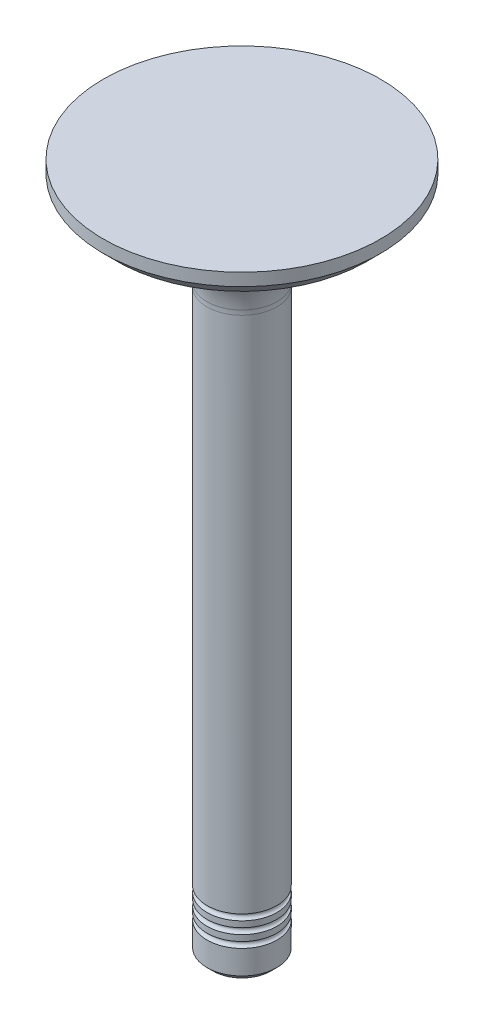
ISO-10303-21;
HEADER;
FILE_DESCRIPTION(('STEP AP214'),'2;1');
FILE_NAME('part.step','',(''),(''),'','','');
FILE_SCHEMA(('AUTOMOTIVE_DESIGN { 1 0 10303 214 1 1 1 1 }'));
ENDSEC;
DATA;
#1=APPLICATION_CONTEXT('core data for automotive mechanical design processes');
#2=APPLICATION_PROTOCOL_DEFINITION('international standard','automotive_design',2000,#1);
#3=PRODUCT_CONTEXT('',#1,'mechanical');
#4=PRODUCT('Part','Part','',(#3));
#5=PRODUCT_RELATED_PRODUCT_CATEGORY('part','',(#4));
#6=PRODUCT_DEFINITION_FORMATION('','',#4);
#7=PRODUCT_DEFINITION_CONTEXT('part definition',#1,'design');
#8=PRODUCT_DEFINITION('design','',#6,#7);
#9=PRODUCT_DEFINITION_SHAPE('','',#8);
#10=(LENGTH_UNIT() NAMED_UNIT(*) SI_UNIT(.MILLI.,.METRE.));
#11=(NAMED_UNIT(*) PLANE_ANGLE_UNIT() SI_UNIT($,.RADIAN.));
#12=(NAMED_UNIT(*) SI_UNIT($,.STERADIAN.) SOLID_ANGLE_UNIT());
#13=UNCERTAINTY_MEASURE_WITH_UNIT(LENGTH_MEASURE(1.E-05),#10,'distance_accuracy_value','');
#14=(GEOMETRIC_REPRESENTATION_CONTEXT(3) GLOBAL_UNCERTAINTY_ASSIGNED_CONTEXT((#13)) GLOBAL_UNIT_ASSIGNED_CONTEXT((#10,
#11,#12)) REPRESENTATION_CONTEXT('',''));
#15=CARTESIAN_POINT('',(0.,0.,0.));
#16=DIRECTION('',(0.,0.,1.));
#17=DIRECTION('',(1.,0.,0.));
#18=AXIS2_PLACEMENT_3D('',#15,#16,#17);
#19=CARTESIAN_POINT('',(0.,105.721798884299,0.));
#20=DIRECTION('',(0.,1.,0.));
#21=DIRECTION('',(-1.,0.,0.));
#22=AXIS2_PLACEMENT_3D('',#19,#20,#21);
#23=CYLINDRICAL_SURFACE('',#22,5.85);
#24=CARTESIAN_POINT('',(0.,87.1884022024718,0.));
#25=DIRECTION('',(0.,1.,0.));
#26=DIRECTION('',(-1.,0.,0.));
#27=AXIS2_PLACEMENT_3D('',#24,#25,#26);
#28=CIRCLE('',#27,5.85);
#29=CARTESIAN_POINT('',(-5.85,87.1884022024718,0.));
#30=VERTEX_POINT('',#29);
#31=EDGE_CURVE('E63',#30,#30,#28,.F.);
#32=ORIENTED_EDGE('',*,*,#31,.T.);
#33=EDGE_LOOP('',(#32));
#34=FACE_BOUND('',#33,.T.);
#35=CARTESIAN_POINT('',(0.,0.321798884299316,0.));
#36=DIRECTION('',(0.,-1.,0.));
#37=DIRECTION('',(0.,0.,-1.));
#38=AXIS2_PLACEMENT_3D('',#35,#36,#37);
#39=CIRCLE('',#38,5.85000000000004);
#40=CARTESIAN_POINT('',(0.,0.321798884299319,-5.85000000000006));
#41=VERTEX_POINT('',#40);
#42=EDGE_CURVE('E97',#41,#41,#39,.T.);
#43=ORIENTED_EDGE('',*,*,#42,.F.);
#44=EDGE_LOOP('',(#43));
#45=FACE_BOUND('',#44,.T.);
#46=ADVANCED_FACE('F47',(#34,#45),#23,.T.);
#47=CARTESIAN_POINT('',(0.,86.8364073315436,0.));
#48=DIRECTION('',(0.,1.,0.));
#49=DIRECTION('',(-1.,0.,0.));
#50=AXIS2_PLACEMENT_3D('',#47,#48,#49);
#51=TOROIDAL_SURFACE('',#50,20.3114172763564,14.4752814998535);
#52=CARTESIAN_POINT('',(0.,87.974933442886,0.));
#53=DIRECTION('',(0.,-1.,0.));
#54=DIRECTION('',(1.,0.,0.));
#55=AXIS2_PLACEMENT_3D('',#52,#53,#54);
#56=CIRCLE('',#55,5.88097955625264);
#57=CARTESIAN_POINT('',(5.88097955625265,87.974933442886,0.));
#58=VERTEX_POINT('',#57);
#59=EDGE_CURVE('E70',#58,#58,#56,.F.);
#60=ORIENTED_EDGE('',*,*,#59,.T.);
#61=EDGE_LOOP('',(#60));
#62=FACE_BOUND('',#61,.T.);
#63=CARTESIAN_POINT('',(0.,101.299798884299,0.));
#64=DIRECTION('',(0.,1.,0.));
#65=DIRECTION('',(-1.,0.,0.));
#66=AXIS2_PLACEMENT_3D('',#63,#64,#65);
#67=CIRCLE('',#66,20.898);
#68=CARTESIAN_POINT('',(-20.898,101.299798884299,0.));
#69=VERTEX_POINT('',#68);
#70=EDGE_CURVE('E76',#69,#69,#67,.T.);
#71=ORIENTED_EDGE('',*,*,#70,.F.);
#72=EDGE_LOOP('',(#71));
#73=FACE_BOUND('',#72,.T.);
#74=ADVANCED_FACE('F135',(#62,#73),#51,.F.);
#75=CARTESIAN_POINT('',(0.,103.621798884299,0.));
#76=DIRECTION('',(0.,1.,0.));
#77=DIRECTION('',(-1.,0.,0.));
#78=AXIS2_PLACEMENT_3D('',#75,#76,#77);
#79=CONICAL_SURFACE('',#78,23.22,0.785398163397453);
#80=ORIENTED_EDGE('',*,*,#70,.T.);
#81=EDGE_LOOP('',(#80));
#82=FACE_BOUND('',#81,.T.);
#83=CARTESIAN_POINT('',(0.,103.621798884299,0.));
#84=DIRECTION('',(0.,1.,0.));
#85=DIRECTION('',(-1.,0.,0.));
#86=AXIS2_PLACEMENT_3D('',#83,#84,#85);
#87=CIRCLE('',#86,23.22);
#88=CARTESIAN_POINT('',(-23.22,103.621798884299,0.));
#89=VERTEX_POINT('',#88);
#90=EDGE_CURVE('E80',#89,#89,#87,.T.);
#91=ORIENTED_EDGE('',*,*,#90,.F.);
#92=EDGE_LOOP('',(#91));
#93=FACE_BOUND('',#92,.T.);
#94=ADVANCED_FACE('F142',(#82,#93),#79,.T.);
#95=CARTESIAN_POINT('',(0.,105.721798884299,0.));
#96=DIRECTION('',(0.,1.,0.));
#97=DIRECTION('',(-1.,0.,0.));
#98=AXIS2_PLACEMENT_3D('',#95,#96,#97);
#99=CYLINDRICAL_SURFACE('',#98,23.22);
#100=ORIENTED_EDGE('',*,*,#90,.T.);
#101=EDGE_LOOP('',(#100));
#102=FACE_BOUND('',#101,.T.);
#103=CARTESIAN_POINT('',(0.,105.721798884299,0.));
#104=DIRECTION('',(0.,1.,0.));
#105=DIRECTION('',(-1.,0.,0.));
#106=AXIS2_PLACEMENT_3D('',#103,#104,#105);
#107=CIRCLE('',#106,23.22);
#108=CARTESIAN_POINT('',(-23.22,105.721798884299,0.));
#109=VERTEX_POINT('',#108);
#110=EDGE_CURVE('E84',#109,#109,#107,.T.);
#111=ORIENTED_EDGE('',*,*,#110,.F.);
#112=EDGE_LOOP('',(#111));
#113=FACE_BOUND('',#112,.T.);
#114=ADVANCED_FACE('F182',(#102,#113),#99,.T.);
#115=CARTESIAN_POINT('',(0.,105.721798884299,0.));
#116=DIRECTION('',(0.,1.,0.));
#117=DIRECTION('',(-1.,0.,0.));
#118=AXIS2_PLACEMENT_3D('',#115,#116,#117);
#119=PLANE('',#118);
#120=ORIENTED_EDGE('',*,*,#110,.T.);
#121=EDGE_LOOP('',(#120));
#122=FACE_BOUND('',#121,.T.);
#123=ADVANCED_FACE('F168',(#122),#119,.T.);
#124=CARTESIAN_POINT('',(0.,87.1884022024718,0.));
#125=DIRECTION('',(0.,1.,0.));
#126=DIRECTION('',(-1.,0.,0.));
#127=AXIS2_PLACEMENT_3D('',#124,#125,#126);
#128=TOROIDAL_SURFACE('',#127,15.85,10.);
#129=ORIENTED_EDGE('',*,*,#31,.F.);
#130=EDGE_LOOP('',(#129));
#131=FACE_BOUND('',#130,.T.);
#132=ORIENTED_EDGE('',*,*,#59,.F.);
#133=EDGE_LOOP('',(#132));
#134=FACE_BOUND('',#133,.T.);
#135=ADVANCED_FACE('F166',(#131,#134),#128,.F.);
#136=CARTESIAN_POINT('',(0.,-0.178201115700685,0.));
#137=DIRECTION('',(0.,-1.,0.));
#138=DIRECTION('',(0.,0.,-1.));
#139=AXIS2_PLACEMENT_3D('',#136,#137,#138);
#140=TOROIDAL_SURFACE('',#139,5.85000000000004,0.5);
#141=ORIENTED_EDGE('',*,*,#42,.T.);
#142=EDGE_LOOP('',(#141));
#143=FACE_BOUND('',#142,.T.);
#144=CARTESIAN_POINT('',(0.,-0.678201115700685,0.));
#145=DIRECTION('',(0.,-1.,0.));
#146=DIRECTION('',(0.,0.,-1.));
#147=AXIS2_PLACEMENT_3D('',#144,#145,#146);
#148=CIRCLE('',#147,5.85000000000004);
#149=CARTESIAN_POINT('',(0.,-0.678201115700682,-5.85000000000006));
#150=VERTEX_POINT('',#149);
#151=EDGE_CURVE('E102',#150,#150,#148,.T.);
#152=ORIENTED_EDGE('',*,*,#151,.F.);
#153=EDGE_LOOP('',(#152));
#154=FACE_BOUND('',#153,.T.);
#155=ADVANCED_FACE('F147',(#143,#154),#140,.F.);
#156=CARTESIAN_POINT('',(0.,-1.67820111570069,0.));
#157=DIRECTION('',(0.,-1.,0.));
#158=DIRECTION('',(0.,0.,-1.));
#159=AXIS2_PLACEMENT_3D('',#156,#157,#158);
#160=CIRCLE('',#159,5.85000000000003);
#161=CARTESIAN_POINT('',(0.,-1.67820111570068,-5.85000000000006));
#162=VERTEX_POINT('',#161);
#163=EDGE_CURVE('E88',#162,#162,#160,.T.);
#164=ORIENTED_EDGE('',*,*,#163,.F.);
#165=EDGE_LOOP('',(#164));
#166=FACE_BOUND('',#165,.T.);
#167=ORIENTED_EDGE('',*,*,#151,.T.);
#168=EDGE_LOOP('',(#167));
#169=FACE_BOUND('',#168,.T.);
#170=ADVANCED_FACE('F132',(#166,#169),#23,.T.);
#171=CARTESIAN_POINT('',(0.,-2.17820111570069,0.));
#172=DIRECTION('',(0.,-1.,0.));
#173=DIRECTION('',(0.,0.,-1.));
#174=AXIS2_PLACEMENT_3D('',#171,#172,#173);
#175=TOROIDAL_SURFACE('',#174,5.85000000000003,0.5);
#176=ORIENTED_EDGE('',*,*,#163,.T.);
#177=EDGE_LOOP('',(#176));
#178=FACE_BOUND('',#177,.T.);
#179=CARTESIAN_POINT('',(0.,-2.67820111570069,0.));
#180=DIRECTION('',(0.,-1.,0.));
#181=DIRECTION('',(0.,0.,-1.));
#182=AXIS2_PLACEMENT_3D('',#179,#180,#181);
#183=CIRCLE('',#182,5.85000000000003);
#184=CARTESIAN_POINT('',(0.,-2.67820111570068,-5.85000000000006));
#185=VERTEX_POINT('',#184);
#186=EDGE_CURVE('E92',#185,#185,#183,.T.);
#187=ORIENTED_EDGE('',*,*,#186,.F.);
#188=EDGE_LOOP('',(#187));
#189=FACE_BOUND('',#188,.T.);
#190=ADVANCED_FACE('F129',(#178,#189),#175,.F.);
#191=ORIENTED_EDGE('',*,*,#186,.T.);
#192=EDGE_LOOP('',(#191));
#193=FACE_BOUND('',#192,.T.);
#194=CARTESIAN_POINT('',(0.,-3.67820111570069,0.));
#195=DIRECTION('',(0.,-1.,0.));
#196=DIRECTION('',(0.,0.,-1.));
#197=AXIS2_PLACEMENT_3D('',#194,#195,#196);
#198=CIRCLE('',#197,5.85000000000002);
#199=CARTESIAN_POINT('',(0.,-3.67820111570068,-5.85000000000005));
#200=VERTEX_POINT('',#199);
#201=EDGE_CURVE('E96',#200,#200,#198,.T.);
#202=ORIENTED_EDGE('',*,*,#201,.F.);
#203=EDGE_LOOP('',(#202));
#204=FACE_BOUND('',#203,.T.);
#205=ADVANCED_FACE('F120',(#193,#204),#23,.T.);
#206=CARTESIAN_POINT('',(0.,-4.17820111570069,0.));
#207=DIRECTION('',(0.,-1.,0.));
#208=DIRECTION('',(0.,0.,-1.));
#209=AXIS2_PLACEMENT_3D('',#206,#207,#208);
#210=TOROIDAL_SURFACE('',#209,5.85000000000002,0.5);
#211=ORIENTED_EDGE('',*,*,#201,.T.);
#212=EDGE_LOOP('',(#211));
#213=FACE_BOUND('',#212,.T.);
#214=CARTESIAN_POINT('',(0.,-4.67820111570069,0.));
#215=DIRECTION('',(0.,-1.,0.));
#216=DIRECTION('',(0.,0.,-1.));
#217=AXIS2_PLACEMENT_3D('',#214,#215,#216);
#218=CIRCLE('',#217,5.85000000000002);
#219=CARTESIAN_POINT('',(0.,-4.67820111570069,-5.85000000000005));
#220=VERTEX_POINT('',#219);
#221=EDGE_CURVE('E101',#220,#220,#218,.T.);
#222=ORIENTED_EDGE('',*,*,#221,.F.);
#223=EDGE_LOOP('',(#222));
#224=FACE_BOUND('',#223,.T.);
#225=ADVANCED_FACE('F117',(#213,#224),#210,.F.);
#226=CARTESIAN_POINT('',(-5.84999999999999,-9.67820111570072,0.));
#227=DIRECTION('',(0.,-1.,0.));
#228=DIRECTION('',(1.,0.,0.));
#229=AXIS2_PLACEMENT_3D('',#226,#227,#228);
#230=PLANE('',#229);
#231=CARTESIAN_POINT('',(0.,-9.67820111570072,0.));
#232=DIRECTION('',(0.,-1.,0.));
#233=DIRECTION('',(1.,0.,0.));
#234=AXIS2_PLACEMENT_3D('',#231,#232,#233);
#235=CIRCLE('',#234,4.84999999999998);
#236=CARTESIAN_POINT('',(4.84999999999999,-9.67820111570072,0.));
#237=VERTEX_POINT('',#236);
#238=EDGE_CURVE('E10',#237,#237,#235,.T.);
#239=ORIENTED_EDGE('',*,*,#238,.T.);
#240=EDGE_LOOP('',(#239));
#241=FACE_BOUND('',#240,.T.);
#242=ADVANCED_FACE('F119',(#241),#230,.T.);
#243=CARTESIAN_POINT('',(0.,-8.67820111570069,0.));
#244=DIRECTION('',(0.,1.,0.));
#245=DIRECTION('',(-1.,0.,0.));
#246=AXIS2_PLACEMENT_3D('',#243,#244,#245);
#247=CONICAL_SURFACE('',#246,5.85,0.785398163397444);
#248=ORIENTED_EDGE('',*,*,#238,.F.);
#249=EDGE_LOOP('',(#248));
#250=FACE_BOUND('',#249,.T.);
#251=CARTESIAN_POINT('',(0.,-8.67820111570069,0.));
#252=DIRECTION('',(0.,-1.,0.));
#253=DIRECTION('',(1.,0.,0.));
#254=AXIS2_PLACEMENT_3D('',#251,#252,#253);
#255=CIRCLE('',#254,5.85);
#256=CARTESIAN_POINT('',(5.85000000000001,-8.67820111570069,0.));
#257=VERTEX_POINT('',#256);
#258=EDGE_CURVE('E56',#257,#257,#255,.F.);
#259=ORIENTED_EDGE('',*,*,#258,.F.);
#260=EDGE_LOOP('',(#259));
#261=FACE_BOUND('',#260,.T.);
#262=ADVANCED_FACE('F50',(#250,#261),#247,.T.);
#263=ORIENTED_EDGE('',*,*,#258,.T.);
#264=EDGE_LOOP('',(#263));
#265=FACE_BOUND('',#264,.T.);
#266=ORIENTED_EDGE('',*,*,#221,.T.);
#267=EDGE_LOOP('',(#266));
#268=FACE_BOUND('',#267,.T.);
#269=ADVANCED_FACE('F115',(#265,#268),#23,.T.);
#270=CLOSED_SHELL('',(#46,#74,#94,#114,#123,#135,#155,#170,#190,#205,#225,#242,#262,#269));
#271=MANIFOLD_SOLID_BREP('B2',#270);
#272=ADVANCED_BREP_SHAPE_REPRESENTATION('',(#18,#271),#14);
#273=SHAPE_DEFINITION_REPRESENTATION(#9,#272);
ENDSEC;
END-ISO-10303-21;
